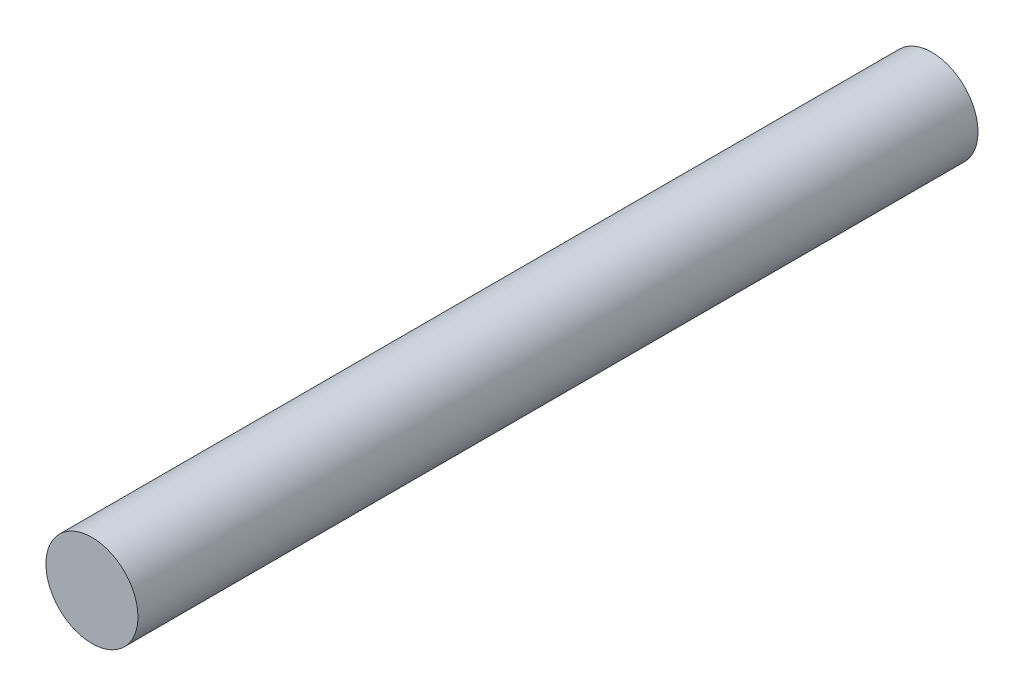
ISO-10303-21;
HEADER;
FILE_DESCRIPTION(('STEP AP214'),'2;1');
FILE_NAME('part.step','',(''),(''),'','','');
FILE_SCHEMA(('AUTOMOTIVE_DESIGN { 1 0 10303 214 1 1 1 1 }'));
ENDSEC;
DATA;
#1=APPLICATION_CONTEXT('core data for automotive mechanical design processes');
#2=APPLICATION_PROTOCOL_DEFINITION('international standard','automotive_design',2000,#1);
#3=PRODUCT_CONTEXT('',#1,'mechanical');
#4=PRODUCT('Part','Part','',(#3));
#5=PRODUCT_RELATED_PRODUCT_CATEGORY('part','',(#4));
#6=PRODUCT_DEFINITION_FORMATION('','',#4);
#7=PRODUCT_DEFINITION_CONTEXT('part definition',#1,'design');
#8=PRODUCT_DEFINITION('design','',#6,#7);
#9=PRODUCT_DEFINITION_SHAPE('','',#8);
#10=(LENGTH_UNIT() NAMED_UNIT(*) SI_UNIT(.MILLI.,.METRE.));
#11=(NAMED_UNIT(*) PLANE_ANGLE_UNIT() SI_UNIT($,.RADIAN.));
#12=(NAMED_UNIT(*) SI_UNIT($,.STERADIAN.) SOLID_ANGLE_UNIT());
#13=UNCERTAINTY_MEASURE_WITH_UNIT(LENGTH_MEASURE(1.E-05),#10,'distance_accuracy_value','');
#14=(GEOMETRIC_REPRESENTATION_CONTEXT(3) GLOBAL_UNCERTAINTY_ASSIGNED_CONTEXT((#13)) GLOBAL_UNIT_ASSIGNED_CONTEXT((#10,
#11,#12)) REPRESENTATION_CONTEXT('',''));
#15=CARTESIAN_POINT('',(0.,0.,0.));
#16=DIRECTION('',(0.,0.,1.));
#17=DIRECTION('',(1.,0.,0.));
#18=AXIS2_PLACEMENT_3D('',#15,#16,#17);
#19=CARTESIAN_POINT('',(0.,0.,60.));
#20=DIRECTION('',(0.,0.,-1.));
#21=DIRECTION('',(-1.,0.,0.));
#22=AXIS2_PLACEMENT_3D('',#19,#20,#21);
#23=CYLINDRICAL_SURFACE('',#22,4.);
#24=CARTESIAN_POINT('',(0.,0.,60.));
#25=DIRECTION('',(0.,0.,1.));
#26=DIRECTION('',(1.,0.,0.));
#27=AXIS2_PLACEMENT_3D('',#24,#25,#26);
#28=CIRCLE('',#27,4.);
#29=CARTESIAN_POINT('',(4.,0.,60.));
#30=VERTEX_POINT('',#29);
#31=EDGE_CURVE('E10',#30,#30,#28,.T.);
#32=ORIENTED_EDGE('',*,*,#31,.F.);
#33=EDGE_LOOP('',(#32));
#34=FACE_BOUND('',#33,.T.);
#35=CARTESIAN_POINT('',(0.,0.,-13.));
#36=DIRECTION('',(0.,0.,1.));
#37=DIRECTION('',(1.,0.,0.));
#38=AXIS2_PLACEMENT_3D('',#35,#36,#37);
#39=CIRCLE('',#38,4.);
#40=CARTESIAN_POINT('',(4.,0.,-13.));
#41=VERTEX_POINT('',#40);
#42=EDGE_CURVE('E40',#41,#41,#39,.T.);
#43=ORIENTED_EDGE('',*,*,#42,.T.);
#44=EDGE_LOOP('',(#43));
#45=FACE_BOUND('',#44,.T.);
#46=ADVANCED_FACE('F34',(#34,#45),#23,.T.);
#47=CARTESIAN_POINT('',(0.,0.,60.));
#48=DIRECTION('',(0.,0.,1.));
#49=DIRECTION('',(1.,0.,0.));
#50=AXIS2_PLACEMENT_3D('',#47,#48,#49);
#51=PLANE('',#50);
#52=ORIENTED_EDGE('',*,*,#31,.T.);
#53=EDGE_LOOP('',(#52));
#54=FACE_BOUND('',#53,.T.);
#55=ADVANCED_FACE('F49',(#54),#51,.T.);
#56=CARTESIAN_POINT('',(0.,0.,-13.));
#57=DIRECTION('',(0.,0.,1.));
#58=DIRECTION('',(1.,0.,0.));
#59=AXIS2_PLACEMENT_3D('',#56,#57,#58);
#60=PLANE('',#59);
#61=ORIENTED_EDGE('',*,*,#42,.F.);
#62=EDGE_LOOP('',(#61));
#63=FACE_BOUND('',#62,.T.);
#64=ADVANCED_FACE('F47',(#63),#60,.F.);
#65=CLOSED_SHELL('',(#46,#55,#64));
#66=MANIFOLD_SOLID_BREP('B2',#65);
#67=ADVANCED_BREP_SHAPE_REPRESENTATION('',(#18,#66),#14);
#68=SHAPE_DEFINITION_REPRESENTATION(#9,#67);
ENDSEC;
END-ISO-10303-21;
